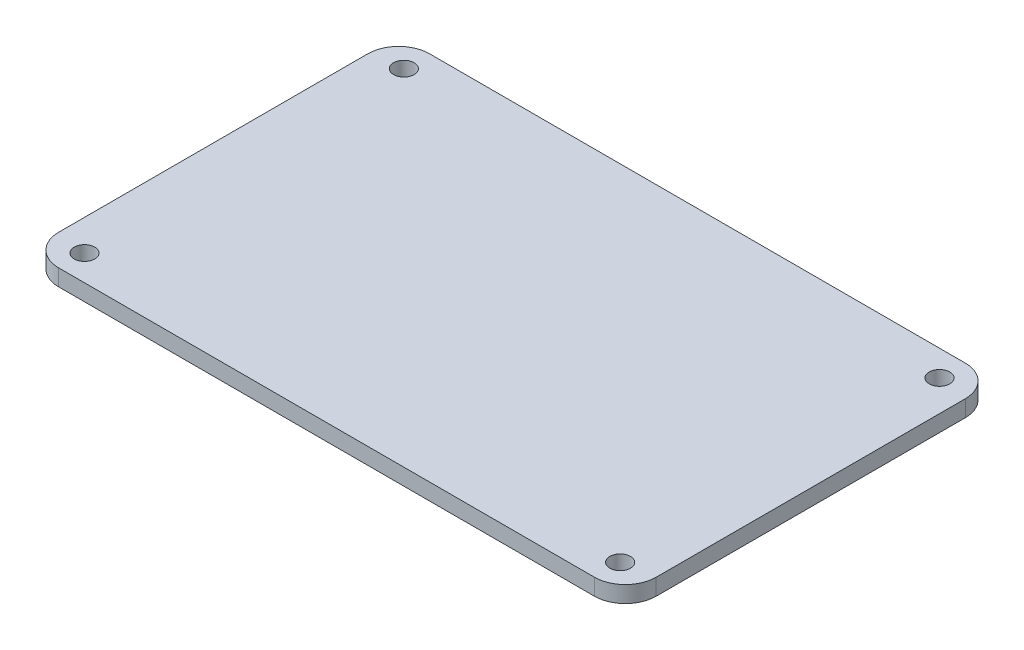
ISO-10303-21;
HEADER;
FILE_DESCRIPTION(('STEP AP214'),'2;1');
FILE_NAME('part.step','',(''),(''),'','','');
FILE_SCHEMA(('AUTOMOTIVE_DESIGN { 1 0 10303 214 1 1 1 1 }'));
ENDSEC;
DATA;
#1=APPLICATION_CONTEXT('core data for automotive mechanical design processes');
#2=APPLICATION_PROTOCOL_DEFINITION('international standard','automotive_design',2000,#1);
#3=PRODUCT_CONTEXT('',#1,'mechanical');
#4=PRODUCT('Part','Part','',(#3));
#5=PRODUCT_RELATED_PRODUCT_CATEGORY('part','',(#4));
#6=PRODUCT_DEFINITION_FORMATION('','',#4);
#7=PRODUCT_DEFINITION_CONTEXT('part definition',#1,'design');
#8=PRODUCT_DEFINITION('design','',#6,#7);
#9=PRODUCT_DEFINITION_SHAPE('','',#8);
#10=(LENGTH_UNIT() NAMED_UNIT(*) SI_UNIT(.MILLI.,.METRE.));
#11=(NAMED_UNIT(*) PLANE_ANGLE_UNIT() SI_UNIT($,.RADIAN.));
#12=(NAMED_UNIT(*) SI_UNIT($,.STERADIAN.) SOLID_ANGLE_UNIT());
#13=UNCERTAINTY_MEASURE_WITH_UNIT(LENGTH_MEASURE(1.E-05),#10,'distance_accuracy_value','');
#14=(GEOMETRIC_REPRESENTATION_CONTEXT(3) GLOBAL_UNCERTAINTY_ASSIGNED_CONTEXT((#13)) GLOBAL_UNIT_ASSIGNED_CONTEXT((#10,
#11,#12)) REPRESENTATION_CONTEXT('',''));
#15=CARTESIAN_POINT('',(0.,0.,0.));
#16=DIRECTION('',(0.,0.,1.));
#17=DIRECTION('',(1.,0.,0.));
#18=AXIS2_PLACEMENT_3D('',#15,#16,#17);
#19=CARTESIAN_POINT('',(0.,1.6,0.));
#20=DIRECTION('',(0.,-1.,0.));
#21=DIRECTION('',(0.,0.,-1.));
#22=AXIS2_PLACEMENT_3D('',#19,#20,#21);
#23=PLANE('',#22);
#24=DIRECTION('',(-1.,0.,0.));
#25=VECTOR('',#24,1.);
#26=CARTESIAN_POINT('',(0.,1.6,-36.));
#27=LINE('',#26,#25);
#28=CARTESIAN_POINT('',(55.,1.6,-36.));
#29=VERTEX_POINT('',#28);
#30=CARTESIAN_POINT('',(3.,1.6,-36.));
#31=VERTEX_POINT('',#30);
#32=EDGE_CURVE('E147',#29,#31,#27,.T.);
#33=ORIENTED_EDGE('',*,*,#32,.T.);
#34=CARTESIAN_POINT('',(3.,1.6,-33.));
#35=DIRECTION('',(0.,-1.,0.));
#36=DIRECTION('',(0.,0.,-1.));
#37=AXIS2_PLACEMENT_3D('',#34,#35,#36);
#38=CIRCLE('',#37,3.);
#39=CARTESIAN_POINT('',(0.,1.6,-33.));
#40=VERTEX_POINT('',#39);
#41=EDGE_CURVE('E177',#31,#40,#38,.F.);
#42=ORIENTED_EDGE('',*,*,#41,.T.);
#43=DIRECTION('',(0.,0.,1.));
#44=VECTOR('',#43,1.);
#45=CARTESIAN_POINT('',(0.,1.6,0.));
#46=LINE('',#45,#44);
#47=CARTESIAN_POINT('',(0.,1.6,-3.));
#48=VERTEX_POINT('',#47);
#49=EDGE_CURVE('E126',#40,#48,#46,.T.);
#50=ORIENTED_EDGE('',*,*,#49,.T.);
#51=CARTESIAN_POINT('',(3.,1.6,-3.));
#52=DIRECTION('',(0.,-1.,0.));
#53=DIRECTION('',(0.,0.,-1.));
#54=AXIS2_PLACEMENT_3D('',#51,#52,#53);
#55=CIRCLE('',#54,3.);
#56=CARTESIAN_POINT('',(3.,1.6,0.));
#57=VERTEX_POINT('',#56);
#58=EDGE_CURVE('E169',#48,#57,#55,.F.);
#59=ORIENTED_EDGE('',*,*,#58,.T.);
#60=DIRECTION('',(1.,0.,0.));
#61=VECTOR('',#60,1.);
#62=CARTESIAN_POINT('',(0.,1.6,0.));
#63=LINE('',#62,#61);
#64=CARTESIAN_POINT('',(55.,1.6,0.));
#65=VERTEX_POINT('',#64);
#66=EDGE_CURVE('E192',#57,#65,#63,.T.);
#67=ORIENTED_EDGE('',*,*,#66,.T.);
#68=CARTESIAN_POINT('',(55.,1.6,-3.));
#69=DIRECTION('',(0.,-1.,0.));
#70=DIRECTION('',(0.,0.,-1.));
#71=AXIS2_PLACEMENT_3D('',#68,#69,#70);
#72=CIRCLE('',#71,3.);
#73=CARTESIAN_POINT('',(58.,1.6,-3.));
#74=VERTEX_POINT('',#73);
#75=EDGE_CURVE('E61',#65,#74,#72,.F.);
#76=ORIENTED_EDGE('',*,*,#75,.T.);
#77=DIRECTION('',(0.,0.,-1.));
#78=VECTOR('',#77,1.);
#79=CARTESIAN_POINT('',(58.,1.6,0.));
#80=LINE('',#79,#78);
#81=CARTESIAN_POINT('',(58.,1.6,-33.));
#82=VERTEX_POINT('',#81);
#83=EDGE_CURVE('E200',#74,#82,#80,.T.);
#84=ORIENTED_EDGE('',*,*,#83,.T.);
#85=CARTESIAN_POINT('',(55.,1.6,-33.));
#86=DIRECTION('',(0.,-1.,0.));
#87=DIRECTION('',(0.,0.,-1.));
#88=AXIS2_PLACEMENT_3D('',#85,#86,#87);
#89=CIRCLE('',#88,3.);
#90=EDGE_CURVE('E174',#82,#29,#89,.F.);
#91=ORIENTED_EDGE('',*,*,#90,.T.);
#92=EDGE_LOOP('',(#33,#42,#50,#59,#67,#76,#84,#91));
#93=FACE_BOUND('',#92,.T.);
#94=CARTESIAN_POINT('',(3.00183203900749,1.6,-2.5));
#95=DIRECTION('',(0.,1.,0.));
#96=DIRECTION('',(0.,0.,1.));
#97=AXIS2_PLACEMENT_3D('',#94,#95,#96);
#98=CIRCLE('',#97,0.999999999999999);
#99=CARTESIAN_POINT('',(3.00183203900749,1.6,-1.5));
#100=VERTEX_POINT('',#99);
#101=EDGE_CURVE('E136',#100,#100,#98,.T.);
#102=ORIENTED_EDGE('',*,*,#101,.F.);
#103=EDGE_LOOP('',(#102));
#104=FACE_BOUND('',#103,.T.);
#105=CARTESIAN_POINT('',(54.9981679609925,1.6,-2.50000000000001));
#106=DIRECTION('',(0.,1.,0.));
#107=DIRECTION('',(0.,0.,1.));
#108=AXIS2_PLACEMENT_3D('',#105,#106,#107);
#109=CIRCLE('',#108,0.999999999999998);
#110=CARTESIAN_POINT('',(54.9981679609925,1.6,-1.50000000000001));
#111=VERTEX_POINT('',#110);
#112=EDGE_CURVE('E212',#111,#111,#109,.T.);
#113=ORIENTED_EDGE('',*,*,#112,.F.);
#114=EDGE_LOOP('',(#113));
#115=FACE_BOUND('',#114,.T.);
#116=CARTESIAN_POINT('',(54.9981679609925,1.6,-33.5));
#117=DIRECTION('',(0.,1.,0.));
#118=DIRECTION('',(0.,0.,1.));
#119=AXIS2_PLACEMENT_3D('',#116,#117,#118);
#120=CIRCLE('',#119,0.999999999999998);
#121=CARTESIAN_POINT('',(54.9981679609925,1.6,-32.5));
#122=VERTEX_POINT('',#121);
#123=EDGE_CURVE('E218',#122,#122,#120,.T.);
#124=ORIENTED_EDGE('',*,*,#123,.F.);
#125=EDGE_LOOP('',(#124));
#126=FACE_BOUND('',#125,.T.);
#127=CARTESIAN_POINT('',(3.00183203900749,1.6,-33.5));
#128=DIRECTION('',(0.,1.,0.));
#129=DIRECTION('',(0.,0.,1.));
#130=AXIS2_PLACEMENT_3D('',#127,#128,#129);
#131=CIRCLE('',#130,1.);
#132=CARTESIAN_POINT('',(3.00183203900749,1.6,-32.5));
#133=VERTEX_POINT('',#132);
#134=EDGE_CURVE('E226',#133,#133,#131,.T.);
#135=ORIENTED_EDGE('',*,*,#134,.F.);
#136=EDGE_LOOP('',(#135));
#137=FACE_BOUND('',#136,.T.);
#138=ADVANCED_FACE('F38',(#93,#104,#115,#126,#137),#23,.F.);
#139=CARTESIAN_POINT('',(0.,0.,0.));
#140=DIRECTION('',(0.,-1.,0.));
#141=DIRECTION('',(0.,0.,-1.));
#142=AXIS2_PLACEMENT_3D('',#139,#140,#141);
#143=PLANE('',#142);
#144=CARTESIAN_POINT('',(54.9981679609925,0.,-33.5));
#145=DIRECTION('',(0.,1.,0.));
#146=DIRECTION('',(0.,0.,1.));
#147=AXIS2_PLACEMENT_3D('',#144,#145,#146);
#148=CIRCLE('',#147,0.999999999999998);
#149=CARTESIAN_POINT('',(54.9981679609925,0.,-32.5));
#150=VERTEX_POINT('',#149);
#151=EDGE_CURVE('E222',#150,#150,#148,.T.);
#152=ORIENTED_EDGE('',*,*,#151,.T.);
#153=EDGE_LOOP('',(#152));
#154=FACE_BOUND('',#153,.T.);
#155=CARTESIAN_POINT('',(3.00183203900749,0.,-2.5));
#156=DIRECTION('',(0.,1.,0.));
#157=DIRECTION('',(0.,0.,1.));
#158=AXIS2_PLACEMENT_3D('',#155,#156,#157);
#159=CIRCLE('',#158,0.999999999999999);
#160=CARTESIAN_POINT('',(3.00183203900749,0.,-1.5));
#161=VERTEX_POINT('',#160);
#162=EDGE_CURVE('E144',#161,#161,#159,.T.);
#163=ORIENTED_EDGE('',*,*,#162,.T.);
#164=EDGE_LOOP('',(#163));
#165=FACE_BOUND('',#164,.T.);
#166=DIRECTION('',(0.,0.,1.));
#167=VECTOR('',#166,1.);
#168=CARTESIAN_POINT('',(0.,0.,0.));
#169=LINE('',#168,#167);
#170=CARTESIAN_POINT('',(0.,0.,-33.));
#171=VERTEX_POINT('',#170);
#172=CARTESIAN_POINT('',(0.,0.,-3.));
#173=VERTEX_POINT('',#172);
#174=EDGE_CURVE('E123',#171,#173,#169,.T.);
#175=ORIENTED_EDGE('',*,*,#174,.F.);
#176=CARTESIAN_POINT('',(3.,0.,-33.));
#177=DIRECTION('',(0.,-1.,0.));
#178=DIRECTION('',(0.,0.,-1.));
#179=AXIS2_PLACEMENT_3D('',#176,#177,#178);
#180=CIRCLE('',#179,3.);
#181=CARTESIAN_POINT('',(3.,0.,-36.));
#182=VERTEX_POINT('',#181);
#183=EDGE_CURVE('E105',#171,#182,#180,.T.);
#184=ORIENTED_EDGE('',*,*,#183,.T.);
#185=DIRECTION('',(-1.,0.,0.));
#186=VECTOR('',#185,1.);
#187=CARTESIAN_POINT('',(0.,0.,-36.));
#188=LINE('',#187,#186);
#189=CARTESIAN_POINT('',(55.,0.,-36.));
#190=VERTEX_POINT('',#189);
#191=EDGE_CURVE('E152',#190,#182,#188,.T.);
#192=ORIENTED_EDGE('',*,*,#191,.F.);
#193=CARTESIAN_POINT('',(55.,0.,-33.));
#194=DIRECTION('',(0.,-1.,0.));
#195=DIRECTION('',(0.,0.,-1.));
#196=AXIS2_PLACEMENT_3D('',#193,#194,#195);
#197=CIRCLE('',#196,3.);
#198=CARTESIAN_POINT('',(58.,0.,-33.));
#199=VERTEX_POINT('',#198);
#200=EDGE_CURVE('E117',#190,#199,#197,.T.);
#201=ORIENTED_EDGE('',*,*,#200,.T.);
#202=DIRECTION('',(0.,0.,-1.));
#203=VECTOR('',#202,1.);
#204=CARTESIAN_POINT('',(58.,0.,0.));
#205=LINE('',#204,#203);
#206=CARTESIAN_POINT('',(58.,0.,-3.));
#207=VERTEX_POINT('',#206);
#208=EDGE_CURVE('E141',#207,#199,#205,.T.);
#209=ORIENTED_EDGE('',*,*,#208,.F.);
#210=CARTESIAN_POINT('',(55.,0.,-3.));
#211=DIRECTION('',(0.,-1.,0.));
#212=DIRECTION('',(0.,0.,-1.));
#213=AXIS2_PLACEMENT_3D('',#210,#211,#212);
#214=CIRCLE('',#213,3.);
#215=CARTESIAN_POINT('',(55.,0.,0.));
#216=VERTEX_POINT('',#215);
#217=EDGE_CURVE('E159',#207,#216,#214,.T.);
#218=ORIENTED_EDGE('',*,*,#217,.T.);
#219=DIRECTION('',(1.,0.,0.));
#220=VECTOR('',#219,1.);
#221=CARTESIAN_POINT('',(0.,0.,0.));
#222=LINE('',#221,#220);
#223=CARTESIAN_POINT('',(3.,0.,0.));
#224=VERTEX_POINT('',#223);
#225=EDGE_CURVE('E135',#224,#216,#222,.T.);
#226=ORIENTED_EDGE('',*,*,#225,.F.);
#227=CARTESIAN_POINT('',(3.,0.,-3.));
#228=DIRECTION('',(0.,-1.,0.));
#229=DIRECTION('',(0.,0.,-1.));
#230=AXIS2_PLACEMENT_3D('',#227,#228,#229);
#231=CIRCLE('',#230,3.);
#232=EDGE_CURVE('E128',#224,#173,#231,.T.);
#233=ORIENTED_EDGE('',*,*,#232,.T.);
#234=EDGE_LOOP('',(#175,#184,#192,#201,#209,#218,#226,#233));
#235=FACE_BOUND('',#234,.T.);
#236=CARTESIAN_POINT('',(54.9981679609925,0.,-2.50000000000001));
#237=DIRECTION('',(0.,1.,0.));
#238=DIRECTION('',(0.,0.,1.));
#239=AXIS2_PLACEMENT_3D('',#236,#237,#238);
#240=CIRCLE('',#239,0.999999999999998);
#241=CARTESIAN_POINT('',(54.9981679609925,0.,-1.50000000000001));
#242=VERTEX_POINT('',#241);
#243=EDGE_CURVE('E214',#242,#242,#240,.T.);
#244=ORIENTED_EDGE('',*,*,#243,.T.);
#245=EDGE_LOOP('',(#244));
#246=FACE_BOUND('',#245,.T.);
#247=CARTESIAN_POINT('',(3.00183203900749,0.,-33.5));
#248=DIRECTION('',(0.,1.,0.));
#249=DIRECTION('',(0.,0.,1.));
#250=AXIS2_PLACEMENT_3D('',#247,#248,#249);
#251=CIRCLE('',#250,1.);
#252=CARTESIAN_POINT('',(3.00183203900749,0.,-32.5));
#253=VERTEX_POINT('',#252);
#254=EDGE_CURVE('E230',#253,#253,#251,.T.);
#255=ORIENTED_EDGE('',*,*,#254,.T.);
#256=EDGE_LOOP('',(#255));
#257=FACE_BOUND('',#256,.T.);
#258=ADVANCED_FACE('F131',(#154,#165,#235,#246,#257),#143,.T.);
#259=CARTESIAN_POINT('',(0.,1.6,0.));
#260=DIRECTION('',(1.,0.,0.));
#261=DIRECTION('',(0.,0.,-1.));
#262=AXIS2_PLACEMENT_3D('',#259,#260,#261);
#263=PLANE('',#262);
#264=ORIENTED_EDGE('',*,*,#49,.F.);
#265=DIRECTION('',(0.,-1.,0.));
#266=VECTOR('',#265,1.);
#267=CARTESIAN_POINT('',(0.,1.6,-33.));
#268=LINE('',#267,#266);
#269=EDGE_CURVE('E109',#40,#171,#268,.T.);
#270=ORIENTED_EDGE('',*,*,#269,.T.);
#271=ORIENTED_EDGE('',*,*,#174,.T.);
#272=DIRECTION('',(0.,-1.,0.));
#273=VECTOR('',#272,1.);
#274=CARTESIAN_POINT('',(0.,1.6,-3.));
#275=LINE('',#274,#273);
#276=EDGE_CURVE('E129',#173,#48,#275,.F.);
#277=ORIENTED_EDGE('',*,*,#276,.T.);
#278=EDGE_LOOP('',(#264,#270,#271,#277));
#279=FACE_BOUND('',#278,.T.);
#280=ADVANCED_FACE('F122',(#279),#263,.F.);
#281=CARTESIAN_POINT('',(0.,1.6,0.));
#282=DIRECTION('',(0.,0.,-1.));
#283=DIRECTION('',(-1.,0.,0.));
#284=AXIS2_PLACEMENT_3D('',#281,#282,#283);
#285=PLANE('',#284);
#286=ORIENTED_EDGE('',*,*,#225,.T.);
#287=DIRECTION('',(0.,-1.,0.));
#288=VECTOR('',#287,1.);
#289=CARTESIAN_POINT('',(55.,1.6,0.));
#290=LINE('',#289,#288);
#291=EDGE_CURVE('E11',#216,#65,#290,.F.);
#292=ORIENTED_EDGE('',*,*,#291,.T.);
#293=ORIENTED_EDGE('',*,*,#66,.F.);
#294=DIRECTION('',(0.,-1.,0.));
#295=VECTOR('',#294,1.);
#296=CARTESIAN_POINT('',(3.,1.6,0.));
#297=LINE('',#296,#295);
#298=EDGE_CURVE('E47',#57,#224,#297,.T.);
#299=ORIENTED_EDGE('',*,*,#298,.T.);
#300=EDGE_LOOP('',(#286,#292,#293,#299));
#301=FACE_BOUND('',#300,.T.);
#302=ADVANCED_FACE('F190',(#301),#285,.F.);
#303=CARTESIAN_POINT('',(58.,1.6,0.));
#304=DIRECTION('',(-1.,0.,0.));
#305=DIRECTION('',(0.,0.,1.));
#306=AXIS2_PLACEMENT_3D('',#303,#304,#305);
#307=PLANE('',#306);
#308=ORIENTED_EDGE('',*,*,#208,.T.);
#309=DIRECTION('',(0.,-1.,0.));
#310=VECTOR('',#309,1.);
#311=CARTESIAN_POINT('',(58.,1.6,-33.));
#312=LINE('',#311,#310);
#313=EDGE_CURVE('E54',#199,#82,#312,.F.);
#314=ORIENTED_EDGE('',*,*,#313,.T.);
#315=ORIENTED_EDGE('',*,*,#83,.F.);
#316=DIRECTION('',(0.,-1.,0.));
#317=VECTOR('',#316,1.);
#318=CARTESIAN_POINT('',(58.,1.6,-3.));
#319=LINE('',#318,#317);
#320=EDGE_CURVE('E180',#74,#207,#319,.T.);
#321=ORIENTED_EDGE('',*,*,#320,.T.);
#322=EDGE_LOOP('',(#308,#314,#315,#321));
#323=FACE_BOUND('',#322,.T.);
#324=ADVANCED_FACE('F199',(#323),#307,.F.);
#325=CARTESIAN_POINT('',(0.,1.6,-36.));
#326=DIRECTION('',(0.,0.,1.));
#327=DIRECTION('',(1.,0.,0.));
#328=AXIS2_PLACEMENT_3D('',#325,#326,#327);
#329=PLANE('',#328);
#330=ORIENTED_EDGE('',*,*,#191,.T.);
#331=DIRECTION('',(0.,-1.,0.));
#332=VECTOR('',#331,1.);
#333=CARTESIAN_POINT('',(3.,1.6,-36.));
#334=LINE('',#333,#332);
#335=EDGE_CURVE('E110',#182,#31,#334,.F.);
#336=ORIENTED_EDGE('',*,*,#335,.T.);
#337=ORIENTED_EDGE('',*,*,#32,.F.);
#338=DIRECTION('',(0.,-1.,0.));
#339=VECTOR('',#338,1.);
#340=CARTESIAN_POINT('',(55.,1.6,-36.));
#341=LINE('',#340,#339);
#342=EDGE_CURVE('E116',#29,#190,#341,.T.);
#343=ORIENTED_EDGE('',*,*,#342,.T.);
#344=EDGE_LOOP('',(#330,#336,#337,#343));
#345=FACE_BOUND('',#344,.T.);
#346=ADVANCED_FACE('F254',(#345),#329,.F.);
#347=CARTESIAN_POINT('',(3.00183203900749,1.6,-2.5));
#348=DIRECTION('',(0.,-1.,0.));
#349=DIRECTION('',(0.,0.,-1.));
#350=AXIS2_PLACEMENT_3D('',#347,#348,#349);
#351=CYLINDRICAL_SURFACE('',#350,0.999999999999999);
#352=ORIENTED_EDGE('',*,*,#101,.T.);
#353=EDGE_LOOP('',(#352));
#354=FACE_BOUND('',#353,.T.);
#355=ORIENTED_EDGE('',*,*,#162,.F.);
#356=EDGE_LOOP('',(#355));
#357=FACE_BOUND('',#356,.T.);
#358=ADVANCED_FACE('F251',(#354,#357),#351,.F.);
#359=CARTESIAN_POINT('',(54.9981679609925,1.6,-2.50000000000001));
#360=DIRECTION('',(0.,-1.,0.));
#361=DIRECTION('',(0.,0.,-1.));
#362=AXIS2_PLACEMENT_3D('',#359,#360,#361);
#363=CYLINDRICAL_SURFACE('',#362,0.999999999999998);
#364=ORIENTED_EDGE('',*,*,#112,.T.);
#365=EDGE_LOOP('',(#364));
#366=FACE_BOUND('',#365,.T.);
#367=ORIENTED_EDGE('',*,*,#243,.F.);
#368=EDGE_LOOP('',(#367));
#369=FACE_BOUND('',#368,.T.);
#370=ADVANCED_FACE('F339',(#366,#369),#363,.F.);
#371=CARTESIAN_POINT('',(54.9981679609925,1.6,-33.5));
#372=DIRECTION('',(0.,-1.,0.));
#373=DIRECTION('',(0.,0.,-1.));
#374=AXIS2_PLACEMENT_3D('',#371,#372,#373);
#375=CYLINDRICAL_SURFACE('',#374,0.999999999999998);
#376=ORIENTED_EDGE('',*,*,#123,.T.);
#377=EDGE_LOOP('',(#376));
#378=FACE_BOUND('',#377,.T.);
#379=ORIENTED_EDGE('',*,*,#151,.F.);
#380=EDGE_LOOP('',(#379));
#381=FACE_BOUND('',#380,.T.);
#382=ADVANCED_FACE('F347',(#378,#381),#375,.F.);
#383=CARTESIAN_POINT('',(3.00183203900749,1.6,-33.5));
#384=DIRECTION('',(0.,-1.,0.));
#385=DIRECTION('',(0.,0.,-1.));
#386=AXIS2_PLACEMENT_3D('',#383,#384,#385);
#387=CYLINDRICAL_SURFACE('',#386,1.);
#388=ORIENTED_EDGE('',*,*,#134,.T.);
#389=EDGE_LOOP('',(#388));
#390=FACE_BOUND('',#389,.T.);
#391=ORIENTED_EDGE('',*,*,#254,.F.);
#392=EDGE_LOOP('',(#391));
#393=FACE_BOUND('',#392,.T.);
#394=ADVANCED_FACE('F238',(#390,#393),#387,.F.);
#395=CARTESIAN_POINT('',(3.,1.6,-33.));
#396=DIRECTION('',(0.,-1.,0.));
#397=DIRECTION('',(0.,0.,-1.));
#398=AXIS2_PLACEMENT_3D('',#395,#396,#397);
#399=CYLINDRICAL_SURFACE('',#398,3.);
#400=ORIENTED_EDGE('',*,*,#41,.F.);
#401=ORIENTED_EDGE('',*,*,#335,.F.);
#402=ORIENTED_EDGE('',*,*,#183,.F.);
#403=ORIENTED_EDGE('',*,*,#269,.F.);
#404=EDGE_LOOP('',(#400,#401,#402,#403));
#405=FACE_BOUND('',#404,.T.);
#406=ADVANCED_FACE('F108',(#405),#399,.T.);
#407=CARTESIAN_POINT('',(55.,1.6,-33.));
#408=DIRECTION('',(0.,-1.,0.));
#409=DIRECTION('',(0.,0.,-1.));
#410=AXIS2_PLACEMENT_3D('',#407,#408,#409);
#411=CYLINDRICAL_SURFACE('',#410,3.);
#412=ORIENTED_EDGE('',*,*,#90,.F.);
#413=ORIENTED_EDGE('',*,*,#313,.F.);
#414=ORIENTED_EDGE('',*,*,#200,.F.);
#415=ORIENTED_EDGE('',*,*,#342,.F.);
#416=EDGE_LOOP('',(#412,#413,#414,#415));
#417=FACE_BOUND('',#416,.T.);
#418=ADVANCED_FACE('F266',(#417),#411,.T.);
#419=CARTESIAN_POINT('',(55.,1.6,-3.));
#420=DIRECTION('',(0.,-1.,0.));
#421=DIRECTION('',(0.,0.,-1.));
#422=AXIS2_PLACEMENT_3D('',#419,#420,#421);
#423=CYLINDRICAL_SURFACE('',#422,3.);
#424=ORIENTED_EDGE('',*,*,#75,.F.);
#425=ORIENTED_EDGE('',*,*,#291,.F.);
#426=ORIENTED_EDGE('',*,*,#217,.F.);
#427=ORIENTED_EDGE('',*,*,#320,.F.);
#428=EDGE_LOOP('',(#424,#425,#426,#427));
#429=FACE_BOUND('',#428,.T.);
#430=ADVANCED_FACE('F198',(#429),#423,.T.);
#431=CARTESIAN_POINT('',(3.,1.6,-3.));
#432=DIRECTION('',(0.,-1.,0.));
#433=DIRECTION('',(0.,0.,-1.));
#434=AXIS2_PLACEMENT_3D('',#431,#432,#433);
#435=CYLINDRICAL_SURFACE('',#434,3.);
#436=ORIENTED_EDGE('',*,*,#58,.F.);
#437=ORIENTED_EDGE('',*,*,#276,.F.);
#438=ORIENTED_EDGE('',*,*,#232,.F.);
#439=ORIENTED_EDGE('',*,*,#298,.F.);
#440=EDGE_LOOP('',(#436,#437,#438,#439));
#441=FACE_BOUND('',#440,.T.);
#442=ADVANCED_FACE('F40',(#441),#435,.T.);
#443=CLOSED_SHELL('',(#138,#258,#280,#302,#324,#346,#358,#370,#382,#394,#406,#418,#430,#442));
#444=MANIFOLD_SOLID_BREP('B2',#443);
#445=ADVANCED_BREP_SHAPE_REPRESENTATION('',(#18,#444),#14);
#446=SHAPE_DEFINITION_REPRESENTATION(#9,#445);
ENDSEC;
END-ISO-10303-21;
